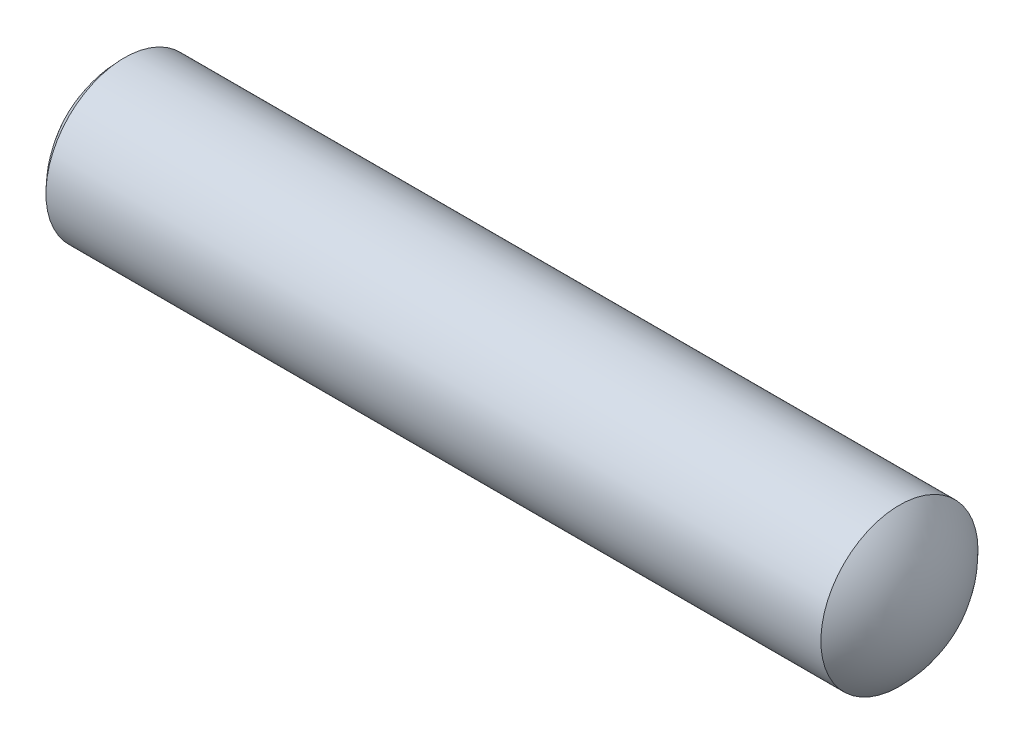
ISO-10303-21;
HEADER;
FILE_DESCRIPTION(('STEP AP214'),'2;1');
FILE_NAME('part.step','',(''),(''),'','','');
FILE_SCHEMA(('AUTOMOTIVE_DESIGN { 1 0 10303 214 1 1 1 1 }'));
ENDSEC;
DATA;
#1=APPLICATION_CONTEXT('core data for automotive mechanical design processes');
#2=APPLICATION_PROTOCOL_DEFINITION('international standard','automotive_design',2000,#1);
#3=PRODUCT_CONTEXT('',#1,'mechanical');
#4=PRODUCT('Part','Part','',(#3));
#5=PRODUCT_RELATED_PRODUCT_CATEGORY('part','',(#4));
#6=PRODUCT_DEFINITION_FORMATION('','',#4);
#7=PRODUCT_DEFINITION_CONTEXT('part definition',#1,'design');
#8=PRODUCT_DEFINITION('design','',#6,#7);
#9=PRODUCT_DEFINITION_SHAPE('','',#8);
#10=(LENGTH_UNIT() NAMED_UNIT(*) SI_UNIT(.MILLI.,.METRE.));
#11=(NAMED_UNIT(*) PLANE_ANGLE_UNIT() SI_UNIT($,.RADIAN.));
#12=(NAMED_UNIT(*) SI_UNIT($,.STERADIAN.) SOLID_ANGLE_UNIT());
#13=UNCERTAINTY_MEASURE_WITH_UNIT(LENGTH_MEASURE(1.E-05),#10,'distance_accuracy_value','');
#14=(GEOMETRIC_REPRESENTATION_CONTEXT(3) GLOBAL_UNCERTAINTY_ASSIGNED_CONTEXT((#13)) GLOBAL_UNIT_ASSIGNED_CONTEXT((#10,
#11,#12)) REPRESENTATION_CONTEXT('',''));
#15=CARTESIAN_POINT('',(0.,0.,0.));
#16=DIRECTION('',(0.,0.,1.));
#17=DIRECTION('',(1.,0.,0.));
#18=AXIS2_PLACEMENT_3D('',#15,#16,#17);
#19=CARTESIAN_POINT('',(15.1875,-17.9292159184645,11.5224074220224));
#20=DIRECTION('',(0.,-0.540640817455599,-0.84125353283118));
#21=DIRECTION('',(1.,0.,0.));
#22=AXIS2_PLACEMENT_3D('',#19,#20,#21);
#23=SPHERICAL_SURFACE('',#22,1.8375);
#24=CARTESIAN_POINT('',(15.1875,-17.9292159184645,11.5224074220224));
#25=DIRECTION('',(-1.,0.,0.));
#26=DIRECTION('',(0.,0.841253532831181,-0.540640817455598));
#27=AXIS2_PLACEMENT_3D('',#24,#25,#26);
#28=SPHERICAL_SURFACE('',#27,1.8375);
#29=CARTESIAN_POINT('',(16.4734821149612,-17.9292159184645,11.5224074220224));
#30=DIRECTION('',(-1.,0.,0.));
#31=DIRECTION('',(0.,0.841253532831181,-0.540640817455598));
#32=AXIS2_PLACEMENT_3D('',#29,#30,#31);
#33=CIRCLE('',#32,1.3125);
#34=CARTESIAN_POINT('',(16.4734821149612,-16.8250706566236,10.8128163491119));
#35=VERTEX_POINT('',#34);
#36=EDGE_CURVE('E11',#35,#35,#33,.T.);
#37=ORIENTED_EDGE('',*,*,#36,.F.);
#38=EDGE_LOOP('',(#37));
#39=FACE_BOUND('',#38,.T.);
#40=ADVANCED_FACE('F17',(#39),#28,.T.);
#41=CARTESIAN_POINT('',(10.,-17.9292159184645,11.5224074220224));
#42=DIRECTION('',(-1.,0.,0.));
#43=DIRECTION('',(0.,0.841253532831181,-0.540640817455598));
#44=AXIS2_PLACEMENT_3D('',#41,#42,#43);
#45=CYLINDRICAL_SURFACE('',#44,1.3125);
#46=CARTESIAN_POINT('',(3.52651788503884,-17.9292159184645,11.5224074220224));
#47=DIRECTION('',(-1.,0.,0.));
#48=DIRECTION('',(0.,0.841253532831181,-0.540640817455598));
#49=AXIS2_PLACEMENT_3D('',#46,#47,#48);
#50=CIRCLE('',#49,1.3125);
#51=CARTESIAN_POINT('',(3.52651788503884,-16.8250706566236,10.8128163491119));
#52=VERTEX_POINT('',#51);
#53=EDGE_CURVE('E21',#52,#52,#50,.T.);
#54=ORIENTED_EDGE('',*,*,#53,.F.);
#55=EDGE_LOOP('',(#54));
#56=FACE_BOUND('',#55,.T.);
#57=ORIENTED_EDGE('',*,*,#36,.T.);
#58=EDGE_LOOP('',(#57));
#59=FACE_BOUND('',#58,.T.);
#60=ADVANCED_FACE('F47',(#56,#59),#45,.T.);
#61=CARTESIAN_POINT('',(4.8125,-17.9292159184645,11.5224074220224));
#62=DIRECTION('',(0.,-0.540640817455597,-0.841253532831182));
#63=DIRECTION('',(-1.,0.,0.));
#64=AXIS2_PLACEMENT_3D('',#61,#62,#63);
#65=SPHERICAL_SURFACE('',#64,1.8375);
#66=CARTESIAN_POINT('',(4.8125,-17.9292159184645,11.5224074220224));
#67=DIRECTION('',(-1.,0.,0.));
#68=DIRECTION('',(0.,0.841253532831181,-0.540640817455598));
#69=AXIS2_PLACEMENT_3D('',#66,#67,#68);
#70=SPHERICAL_SURFACE('',#69,1.8375);
#71=ORIENTED_EDGE('',*,*,#53,.T.);
#72=EDGE_LOOP('',(#71));
#73=FACE_BOUND('',#72,.T.);
#74=ADVANCED_FACE('F19',(#73),#70,.T.);
#75=CLOSED_SHELL('',(#40,#60,#74));
#76=MANIFOLD_SOLID_BREP('B1',#75);
#77=ADVANCED_BREP_SHAPE_REPRESENTATION('',(#18,#76),#14);
#78=SHAPE_DEFINITION_REPRESENTATION(#9,#77);
ENDSEC;
END-ISO-10303-21;
